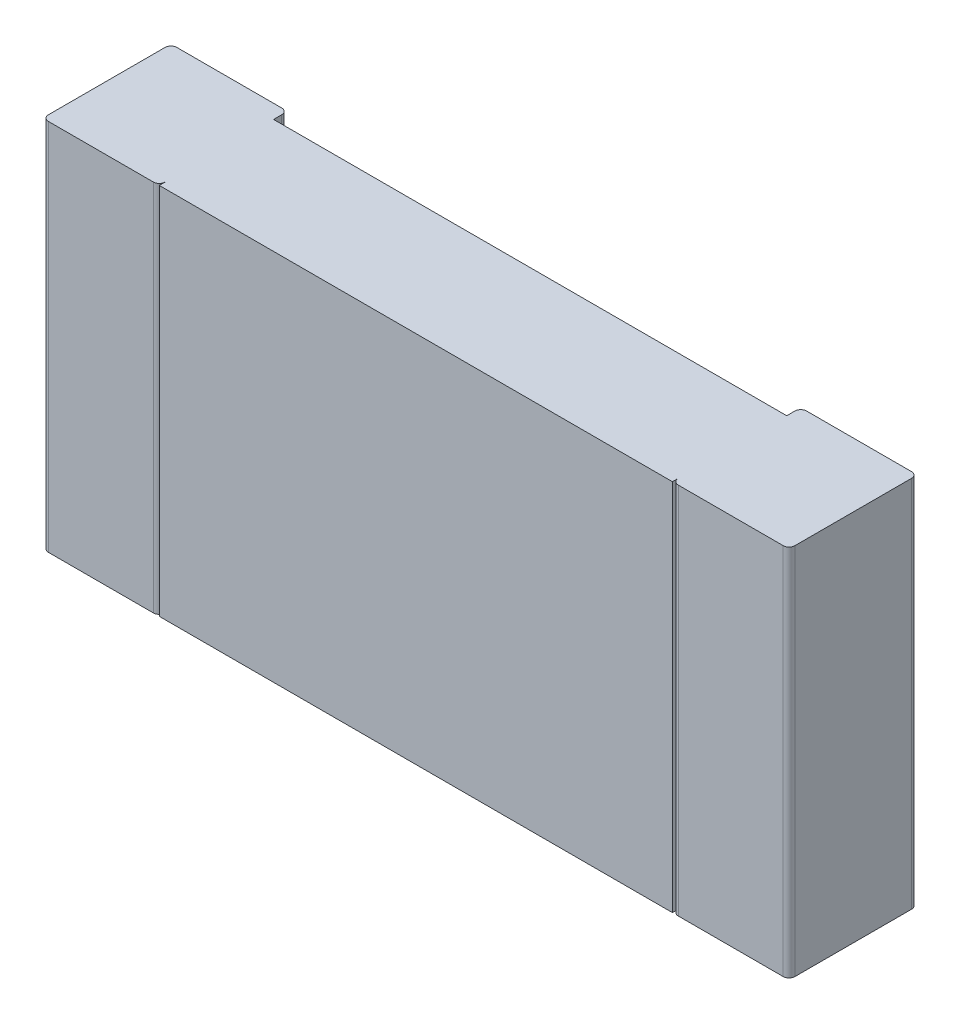
ISO-10303-21;
HEADER;
FILE_DESCRIPTION(('STEP AP214'),'2;1');
FILE_NAME('part.step','',(''),(''),'','','');
FILE_SCHEMA(('AUTOMOTIVE_DESIGN { 1 0 10303 214 1 1 1 1 }'));
ENDSEC;
DATA;
#1=APPLICATION_CONTEXT('core data for automotive mechanical design processes');
#2=APPLICATION_PROTOCOL_DEFINITION('international standard','automotive_design',2000,#1);
#3=PRODUCT_CONTEXT('',#1,'mechanical');
#4=PRODUCT('Part','Part','',(#3));
#5=PRODUCT_RELATED_PRODUCT_CATEGORY('part','',(#4));
#6=PRODUCT_DEFINITION_FORMATION('','',#4);
#7=PRODUCT_DEFINITION_CONTEXT('part definition',#1,'design');
#8=PRODUCT_DEFINITION('design','',#6,#7);
#9=PRODUCT_DEFINITION_SHAPE('','',#8);
#10=(LENGTH_UNIT() NAMED_UNIT(*) SI_UNIT(.MILLI.,.METRE.));
#11=(NAMED_UNIT(*) PLANE_ANGLE_UNIT() SI_UNIT($,.RADIAN.));
#12=(NAMED_UNIT(*) SI_UNIT($,.STERADIAN.) SOLID_ANGLE_UNIT());
#13=UNCERTAINTY_MEASURE_WITH_UNIT(LENGTH_MEASURE(1.E-05),#10,'distance_accuracy_value','');
#14=(GEOMETRIC_REPRESENTATION_CONTEXT(3) GLOBAL_UNCERTAINTY_ASSIGNED_CONTEXT((#13)) GLOBAL_UNIT_ASSIGNED_CONTEXT((#10,
#11,#12)) REPRESENTATION_CONTEXT('',''));
#15=CARTESIAN_POINT('',(0.,0.,0.));
#16=DIRECTION('',(0.,0.,1.));
#17=DIRECTION('',(1.,0.,0.));
#18=AXIS2_PLACEMENT_3D('',#15,#16,#17);
#19=CARTESIAN_POINT('',(-1.575,-0.8,0.025));
#20=DIRECTION('',(0.,1.,0.));
#21=DIRECTION('',(0.,0.,1.));
#22=AXIS2_PLACEMENT_3D('',#19,#20,#21);
#23=CYLINDRICAL_SURFACE('',#22,0.025);
#24=DIRECTION('',(0.,1.,0.));
#25=VECTOR('',#24,1.);
#26=CARTESIAN_POINT('',(-1.575,-0.8,0.));
#27=LINE('',#26,#25);
#28=CARTESIAN_POINT('',(-1.575,0.8,0.));
#29=VERTEX_POINT('',#28);
#30=CARTESIAN_POINT('',(-1.575,-0.8,0.));
#31=VERTEX_POINT('',#30);
#32=EDGE_CURVE('E199',#29,#31,#27,.F.);
#33=ORIENTED_EDGE('',*,*,#32,.T.);
#34=CARTESIAN_POINT('',(-1.575,-0.8,0.025));
#35=DIRECTION('',(0.,1.,0.));
#36=DIRECTION('',(0.,0.,1.));
#37=AXIS2_PLACEMENT_3D('',#34,#35,#36);
#38=CIRCLE('',#37,0.025);
#39=CARTESIAN_POINT('',(-1.6,-0.8,0.025));
#40=VERTEX_POINT('',#39);
#41=EDGE_CURVE('E161',#31,#40,#38,.T.);
#42=ORIENTED_EDGE('',*,*,#41,.T.);
#43=DIRECTION('',(0.,1.,0.));
#44=VECTOR('',#43,1.);
#45=CARTESIAN_POINT('',(-1.6,-0.8,0.025));
#46=LINE('',#45,#44);
#47=CARTESIAN_POINT('',(-1.6,0.8,0.025));
#48=VERTEX_POINT('',#47);
#49=EDGE_CURVE('E164',#40,#48,#46,.T.);
#50=ORIENTED_EDGE('',*,*,#49,.T.);
#51=CARTESIAN_POINT('',(-1.575,0.8,0.025));
#52=DIRECTION('',(0.,1.,0.));
#53=DIRECTION('',(0.,0.,1.));
#54=AXIS2_PLACEMENT_3D('',#51,#52,#53);
#55=CIRCLE('',#54,0.025);
#56=EDGE_CURVE('E20',#48,#29,#55,.F.);
#57=ORIENTED_EDGE('',*,*,#56,.T.);
#58=EDGE_LOOP('',(#33,#42,#50,#57));
#59=FACE_BOUND('',#58,.T.);
#60=ADVANCED_FACE('F17',(#59),#23,.T.);
#61=CARTESIAN_POINT('',(1.575,-0.8,0.025));
#62=DIRECTION('',(0.,1.,0.));
#63=DIRECTION('',(0.,0.,1.));
#64=AXIS2_PLACEMENT_3D('',#61,#62,#63);
#65=CYLINDRICAL_SURFACE('',#64,0.025);
#66=CARTESIAN_POINT('',(1.575,0.8,0.025));
#67=DIRECTION('',(0.,1.,0.));
#68=DIRECTION('',(0.,0.,1.));
#69=AXIS2_PLACEMENT_3D('',#66,#67,#68);
#70=CIRCLE('',#69,0.025);
#71=CARTESIAN_POINT('',(1.575,0.8,0.));
#72=VERTEX_POINT('',#71);
#73=CARTESIAN_POINT('',(1.6,0.8,0.025));
#74=VERTEX_POINT('',#73);
#75=EDGE_CURVE('E200',#72,#74,#70,.F.);
#76=ORIENTED_EDGE('',*,*,#75,.T.);
#77=DIRECTION('',(0.,1.,0.));
#78=VECTOR('',#77,1.);
#79=CARTESIAN_POINT('',(1.6,-0.8,0.025));
#80=LINE('',#79,#78);
#81=CARTESIAN_POINT('',(1.6,-0.8,0.025));
#82=VERTEX_POINT('',#81);
#83=EDGE_CURVE('E176',#82,#74,#80,.T.);
#84=ORIENTED_EDGE('',*,*,#83,.F.);
#85=CARTESIAN_POINT('',(1.575,-0.8,0.025));
#86=DIRECTION('',(0.,1.,0.));
#87=DIRECTION('',(0.,0.,1.));
#88=AXIS2_PLACEMENT_3D('',#85,#86,#87);
#89=CIRCLE('',#88,0.025);
#90=CARTESIAN_POINT('',(1.575,-0.8,0.));
#91=VERTEX_POINT('',#90);
#92=EDGE_CURVE('E244',#82,#91,#89,.T.);
#93=ORIENTED_EDGE('',*,*,#92,.T.);
#94=DIRECTION('',(0.,1.,0.));
#95=VECTOR('',#94,1.);
#96=CARTESIAN_POINT('',(1.575,-0.8,0.));
#97=LINE('',#96,#95);
#98=EDGE_CURVE('E182',#91,#72,#97,.T.);
#99=ORIENTED_EDGE('',*,*,#98,.T.);
#100=EDGE_LOOP('',(#76,#84,#93,#99));
#101=FACE_BOUND('',#100,.T.);
#102=ADVANCED_FACE('F249',(#101),#65,.T.);
#103=CARTESIAN_POINT('',(-1.6,-0.8,0.));
#104=DIRECTION('',(0.,0.,1.));
#105=DIRECTION('',(1.,0.,0.));
#106=AXIS2_PLACEMENT_3D('',#103,#104,#105);
#107=PLANE('',#106);
#108=DIRECTION('',(1.,0.,0.));
#109=VECTOR('',#108,1.);
#110=CARTESIAN_POINT('',(-1.6,-0.8,0.));
#111=LINE('',#110,#109);
#112=CARTESIAN_POINT('',(-1.125,-0.8,0.));
#113=VERTEX_POINT('',#112);
#114=EDGE_CURVE('E192',#31,#113,#111,.T.);
#115=ORIENTED_EDGE('',*,*,#114,.F.);
#116=ORIENTED_EDGE('',*,*,#32,.F.);
#117=DIRECTION('',(1.,0.,0.));
#118=VECTOR('',#117,1.);
#119=CARTESIAN_POINT('',(-1.6,0.8,0.));
#120=LINE('',#119,#118);
#121=CARTESIAN_POINT('',(-1.125,0.8,0.));
#122=VERTEX_POINT('',#121);
#123=EDGE_CURVE('E157',#122,#29,#120,.F.);
#124=ORIENTED_EDGE('',*,*,#123,.F.);
#125=DIRECTION('',(0.,1.,0.));
#126=VECTOR('',#125,1.);
#127=CARTESIAN_POINT('',(-1.125,-0.8,0.));
#128=LINE('',#127,#126);
#129=EDGE_CURVE('E193',#113,#122,#128,.T.);
#130=ORIENTED_EDGE('',*,*,#129,.F.);
#131=EDGE_LOOP('',(#115,#116,#124,#130));
#132=FACE_BOUND('',#131,.T.);
#133=ADVANCED_FACE('F543',(#132),#107,.F.);
#134=CARTESIAN_POINT('',(1.1,-0.8,0.));
#135=DIRECTION('',(0.,0.,1.));
#136=DIRECTION('',(1.,0.,0.));
#137=AXIS2_PLACEMENT_3D('',#134,#135,#136);
#138=PLANE('',#137);
#139=DIRECTION('',(1.,0.,0.));
#140=VECTOR('',#139,1.);
#141=CARTESIAN_POINT('',(1.1,-0.8,0.));
#142=LINE('',#141,#140);
#143=CARTESIAN_POINT('',(1.125,-0.8,0.));
#144=VERTEX_POINT('',#143);
#145=EDGE_CURVE('E188',#144,#91,#142,.T.);
#146=ORIENTED_EDGE('',*,*,#145,.F.);
#147=DIRECTION('',(0.,1.,0.));
#148=VECTOR('',#147,1.);
#149=CARTESIAN_POINT('',(1.125,-0.8,0.));
#150=LINE('',#149,#148);
#151=CARTESIAN_POINT('',(1.125,0.8,0.));
#152=VERTEX_POINT('',#151);
#153=EDGE_CURVE('E183',#152,#144,#150,.F.);
#154=ORIENTED_EDGE('',*,*,#153,.F.);
#155=DIRECTION('',(1.,0.,0.));
#156=VECTOR('',#155,1.);
#157=CARTESIAN_POINT('',(1.1,0.8,0.));
#158=LINE('',#157,#156);
#159=EDGE_CURVE('E190',#72,#152,#158,.F.);
#160=ORIENTED_EDGE('',*,*,#159,.F.);
#161=ORIENTED_EDGE('',*,*,#98,.F.);
#162=EDGE_LOOP('',(#146,#154,#160,#161));
#163=FACE_BOUND('',#162,.T.);
#164=ADVANCED_FACE('F253',(#163),#138,.F.);
#165=CARTESIAN_POINT('',(-1.6,-0.8,0.));
#166=DIRECTION('',(1.,0.,0.));
#167=DIRECTION('',(0.,0.,-1.));
#168=AXIS2_PLACEMENT_3D('',#165,#166,#167);
#169=PLANE('',#168);
#170=DIRECTION('',(0.,0.,-1.));
#171=VECTOR('',#170,1.);
#172=CARTESIAN_POINT('',(-1.6,0.8,0.));
#173=LINE('',#172,#171);
#174=CARTESIAN_POINT('',(-1.6,0.8,0.525));
#175=VERTEX_POINT('',#174);
#176=EDGE_CURVE('E154',#48,#175,#173,.F.);
#177=ORIENTED_EDGE('',*,*,#176,.F.);
#178=ORIENTED_EDGE('',*,*,#49,.F.);
#179=DIRECTION('',(0.,0.,-1.));
#180=VECTOR('',#179,1.);
#181=CARTESIAN_POINT('',(-1.6,-0.8,0.));
#182=LINE('',#181,#180);
#183=CARTESIAN_POINT('',(-1.6,-0.8,0.525));
#184=VERTEX_POINT('',#183);
#185=EDGE_CURVE('E167',#184,#40,#182,.T.);
#186=ORIENTED_EDGE('',*,*,#185,.F.);
#187=DIRECTION('',(0.,1.,0.));
#188=VECTOR('',#187,1.);
#189=CARTESIAN_POINT('',(-1.6,-0.8,0.525));
#190=LINE('',#189,#188);
#191=EDGE_CURVE('E171',#175,#184,#190,.F.);
#192=ORIENTED_EDGE('',*,*,#191,.F.);
#193=EDGE_LOOP('',(#177,#178,#186,#192));
#194=FACE_BOUND('',#193,.T.);
#195=ADVANCED_FACE('F169',(#194),#169,.F.);
#196=CARTESIAN_POINT('',(1.6,-0.8,0.));
#197=DIRECTION('',(1.,0.,0.));
#198=DIRECTION('',(0.,0.,-1.));
#199=AXIS2_PLACEMENT_3D('',#196,#197,#198);
#200=PLANE('',#199);
#201=DIRECTION('',(0.,0.,-1.));
#202=VECTOR('',#201,1.);
#203=CARTESIAN_POINT('',(1.6,0.8,0.));
#204=LINE('',#203,#202);
#205=CARTESIAN_POINT('',(1.6,0.8,0.525));
#206=VERTEX_POINT('',#205);
#207=EDGE_CURVE('E203',#74,#206,#204,.F.);
#208=ORIENTED_EDGE('',*,*,#207,.T.);
#209=DIRECTION('',(0.,1.,0.));
#210=VECTOR('',#209,1.);
#211=CARTESIAN_POINT('',(1.6,-0.8,0.525));
#212=LINE('',#211,#210);
#213=CARTESIAN_POINT('',(1.6,-0.8,0.525));
#214=VERTEX_POINT('',#213);
#215=EDGE_CURVE('E231',#214,#206,#212,.T.);
#216=ORIENTED_EDGE('',*,*,#215,.F.);
#217=DIRECTION('',(0.,0.,-1.));
#218=VECTOR('',#217,1.);
#219=CARTESIAN_POINT('',(1.6,-0.8,0.));
#220=LINE('',#219,#218);
#221=EDGE_CURVE('E173',#214,#82,#220,.T.);
#222=ORIENTED_EDGE('',*,*,#221,.T.);
#223=ORIENTED_EDGE('',*,*,#83,.T.);
#224=EDGE_LOOP('',(#208,#216,#222,#223));
#225=FACE_BOUND('',#224,.T.);
#226=ADVANCED_FACE('F262',(#225),#200,.T.);
#227=CARTESIAN_POINT('',(-1.125,-0.8,0.025));
#228=DIRECTION('',(0.,1.,0.));
#229=DIRECTION('',(0.,0.,1.));
#230=AXIS2_PLACEMENT_3D('',#227,#228,#229);
#231=CYLINDRICAL_SURFACE('',#230,0.025);
#232=CARTESIAN_POINT('',(-1.125,0.8,0.025));
#233=DIRECTION('',(0.,1.,0.));
#234=DIRECTION('',(0.,0.,1.));
#235=AXIS2_PLACEMENT_3D('',#232,#233,#234);
#236=CIRCLE('',#235,0.025);
#237=CARTESIAN_POINT('',(-1.1,0.8,0.025));
#238=VERTEX_POINT('',#237);
#239=EDGE_CURVE('E196',#122,#238,#236,.F.);
#240=ORIENTED_EDGE('',*,*,#239,.T.);
#241=DIRECTION('',(0.,1.,0.));
#242=VECTOR('',#241,1.);
#243=CARTESIAN_POINT('',(-1.1,-0.8,0.025));
#244=LINE('',#243,#242);
#245=CARTESIAN_POINT('',(-1.1,-0.8,0.025));
#246=VERTEX_POINT('',#245);
#247=EDGE_CURVE('E324',#246,#238,#244,.T.);
#248=ORIENTED_EDGE('',*,*,#247,.F.);
#249=CARTESIAN_POINT('',(-1.125,-0.8,0.025));
#250=DIRECTION('',(0.,1.,0.));
#251=DIRECTION('',(0.,0.,1.));
#252=AXIS2_PLACEMENT_3D('',#249,#250,#251);
#253=CIRCLE('',#252,0.025);
#254=EDGE_CURVE('E197',#246,#113,#253,.T.);
#255=ORIENTED_EDGE('',*,*,#254,.T.);
#256=ORIENTED_EDGE('',*,*,#129,.T.);
#257=EDGE_LOOP('',(#240,#248,#255,#256));
#258=FACE_BOUND('',#257,.T.);
#259=ADVANCED_FACE('F516',(#258),#231,.T.);
#260=CARTESIAN_POINT('',(1.125,-0.8,0.025));
#261=DIRECTION('',(0.,1.,0.));
#262=DIRECTION('',(0.,0.,1.));
#263=AXIS2_PLACEMENT_3D('',#260,#261,#262);
#264=CYLINDRICAL_SURFACE('',#263,0.025);
#265=ORIENTED_EDGE('',*,*,#153,.T.);
#266=CARTESIAN_POINT('',(1.125,-0.8,0.025));
#267=DIRECTION('',(0.,1.,0.));
#268=DIRECTION('',(0.,0.,1.));
#269=AXIS2_PLACEMENT_3D('',#266,#267,#268);
#270=CIRCLE('',#269,0.025);
#271=CARTESIAN_POINT('',(1.1,-0.8,0.025));
#272=VERTEX_POINT('',#271);
#273=EDGE_CURVE('E186',#144,#272,#270,.T.);
#274=ORIENTED_EDGE('',*,*,#273,.T.);
#275=DIRECTION('',(0.,1.,0.));
#276=VECTOR('',#275,1.);
#277=CARTESIAN_POINT('',(1.1,-0.8,0.025));
#278=LINE('',#277,#276);
#279=CARTESIAN_POINT('',(1.1,0.8,0.025));
#280=VERTEX_POINT('',#279);
#281=EDGE_CURVE('E316',#272,#280,#278,.T.);
#282=ORIENTED_EDGE('',*,*,#281,.T.);
#283=CARTESIAN_POINT('',(1.125,0.8,0.025));
#284=DIRECTION('',(0.,1.,0.));
#285=DIRECTION('',(0.,0.,1.));
#286=AXIS2_PLACEMENT_3D('',#283,#284,#285);
#287=CIRCLE('',#286,0.025);
#288=EDGE_CURVE('E187',#280,#152,#287,.F.);
#289=ORIENTED_EDGE('',*,*,#288,.T.);
#290=EDGE_LOOP('',(#265,#274,#282,#289));
#291=FACE_BOUND('',#290,.T.);
#292=ADVANCED_FACE('F509',(#291),#264,.T.);
#293=CARTESIAN_POINT('',(-1.575,-0.8,0.525));
#294=DIRECTION('',(0.,1.,0.));
#295=DIRECTION('',(0.,0.,1.));
#296=AXIS2_PLACEMENT_3D('',#293,#294,#295);
#297=CYLINDRICAL_SURFACE('',#296,0.025);
#298=CARTESIAN_POINT('',(-1.575,0.8,0.525));
#299=DIRECTION('',(0.,1.,0.));
#300=DIRECTION('',(0.,0.,1.));
#301=AXIS2_PLACEMENT_3D('',#298,#299,#300);
#302=CIRCLE('',#301,0.025);
#303=CARTESIAN_POINT('',(-1.575,0.8,0.55));
#304=VERTEX_POINT('',#303);
#305=EDGE_CURVE('E232',#304,#175,#302,.F.);
#306=ORIENTED_EDGE('',*,*,#305,.T.);
#307=ORIENTED_EDGE('',*,*,#191,.T.);
#308=CARTESIAN_POINT('',(-1.575,-0.8,0.525));
#309=DIRECTION('',(0.,1.,0.));
#310=DIRECTION('',(0.,0.,1.));
#311=AXIS2_PLACEMENT_3D('',#308,#309,#310);
#312=CIRCLE('',#311,0.025);
#313=CARTESIAN_POINT('',(-1.575,-0.8,0.55));
#314=VERTEX_POINT('',#313);
#315=EDGE_CURVE('E234',#184,#314,#312,.T.);
#316=ORIENTED_EDGE('',*,*,#315,.T.);
#317=DIRECTION('',(0.,1.,0.));
#318=VECTOR('',#317,1.);
#319=CARTESIAN_POINT('',(-1.575,-0.8,0.55));
#320=LINE('',#319,#318);
#321=EDGE_CURVE('E311',#304,#314,#320,.F.);
#322=ORIENTED_EDGE('',*,*,#321,.F.);
#323=EDGE_LOOP('',(#306,#307,#316,#322));
#324=FACE_BOUND('',#323,.T.);
#325=ADVANCED_FACE('F337',(#324),#297,.T.);
#326=CARTESIAN_POINT('',(1.575,-0.8,0.525));
#327=DIRECTION('',(0.,1.,0.));
#328=DIRECTION('',(0.,0.,1.));
#329=AXIS2_PLACEMENT_3D('',#326,#327,#328);
#330=CYLINDRICAL_SURFACE('',#329,0.025);
#331=DIRECTION('',(0.,1.,0.));
#332=VECTOR('',#331,1.);
#333=CARTESIAN_POINT('',(1.575,-0.8,0.55));
#334=LINE('',#333,#332);
#335=CARTESIAN_POINT('',(1.575,-0.8,0.55));
#336=VERTEX_POINT('',#335);
#337=CARTESIAN_POINT('',(1.575,0.8,0.55));
#338=VERTEX_POINT('',#337);
#339=EDGE_CURVE('E269',#336,#338,#334,.T.);
#340=ORIENTED_EDGE('',*,*,#339,.F.);
#341=CARTESIAN_POINT('',(1.575,-0.8,0.525));
#342=DIRECTION('',(0.,1.,0.));
#343=DIRECTION('',(0.,0.,1.));
#344=AXIS2_PLACEMENT_3D('',#341,#342,#343);
#345=CIRCLE('',#344,0.025);
#346=EDGE_CURVE('E224',#336,#214,#345,.T.);
#347=ORIENTED_EDGE('',*,*,#346,.T.);
#348=ORIENTED_EDGE('',*,*,#215,.T.);
#349=CARTESIAN_POINT('',(1.575,0.8,0.525));
#350=DIRECTION('',(0.,1.,0.));
#351=DIRECTION('',(0.,0.,1.));
#352=AXIS2_PLACEMENT_3D('',#349,#350,#351);
#353=CIRCLE('',#352,0.025);
#354=EDGE_CURVE('E228',#206,#338,#353,.F.);
#355=ORIENTED_EDGE('',*,*,#354,.T.);
#356=EDGE_LOOP('',(#340,#347,#348,#355));
#357=FACE_BOUND('',#356,.T.);
#358=ADVANCED_FACE('F270',(#357),#330,.T.);
#359=CARTESIAN_POINT('',(-1.1,-0.8,0.));
#360=DIRECTION('',(1.,0.,0.));
#361=DIRECTION('',(0.,0.,-1.));
#362=AXIS2_PLACEMENT_3D('',#359,#360,#361);
#363=PLANE('',#362);
#364=DIRECTION('',(0.,0.,-1.));
#365=VECTOR('',#364,1.);
#366=CARTESIAN_POINT('',(-1.1,0.8,0.));
#367=LINE('',#366,#365);
#368=CARTESIAN_POINT('',(-1.1,0.8,0.06));
#369=VERTEX_POINT('',#368);
#370=EDGE_CURVE('E317',#238,#369,#367,.F.);
#371=ORIENTED_EDGE('',*,*,#370,.T.);
#372=DIRECTION('',(0.,1.,0.));
#373=VECTOR('',#372,1.);
#374=CARTESIAN_POINT('',(-1.1,-0.8,0.06));
#375=LINE('',#374,#373);
#376=CARTESIAN_POINT('',(-1.1,-0.8,0.06));
#377=VERTEX_POINT('',#376);
#378=EDGE_CURVE('E272',#369,#377,#375,.F.);
#379=ORIENTED_EDGE('',*,*,#378,.T.);
#380=DIRECTION('',(0.,0.,-1.));
#381=VECTOR('',#380,1.);
#382=CARTESIAN_POINT('',(-1.1,-0.8,0.));
#383=LINE('',#382,#381);
#384=EDGE_CURVE('E227',#377,#246,#383,.T.);
#385=ORIENTED_EDGE('',*,*,#384,.T.);
#386=ORIENTED_EDGE('',*,*,#247,.T.);
#387=EDGE_LOOP('',(#371,#379,#385,#386));
#388=FACE_BOUND('',#387,.T.);
#389=ADVANCED_FACE('F488',(#388),#363,.T.);
#390=CARTESIAN_POINT('',(1.1,-0.8,0.));
#391=DIRECTION('',(1.,0.,0.));
#392=DIRECTION('',(0.,0.,-1.));
#393=AXIS2_PLACEMENT_3D('',#390,#391,#392);
#394=PLANE('',#393);
#395=DIRECTION('',(0.,0.,-1.));
#396=VECTOR('',#395,1.);
#397=CARTESIAN_POINT('',(1.1,0.8,0.));
#398=LINE('',#397,#396);
#399=CARTESIAN_POINT('',(1.1,0.8,0.06));
#400=VERTEX_POINT('',#399);
#401=EDGE_CURVE('E312',#280,#400,#398,.F.);
#402=ORIENTED_EDGE('',*,*,#401,.F.);
#403=ORIENTED_EDGE('',*,*,#281,.F.);
#404=DIRECTION('',(0.,0.,-1.));
#405=VECTOR('',#404,1.);
#406=CARTESIAN_POINT('',(1.1,-0.8,0.));
#407=LINE('',#406,#405);
#408=CARTESIAN_POINT('',(1.1,-0.8,0.06));
#409=VERTEX_POINT('',#408);
#410=EDGE_CURVE('E314',#409,#272,#407,.T.);
#411=ORIENTED_EDGE('',*,*,#410,.F.);
#412=DIRECTION('',(0.,1.,0.));
#413=VECTOR('',#412,1.);
#414=CARTESIAN_POINT('',(1.1,-0.8,0.06));
#415=LINE('',#414,#413);
#416=EDGE_CURVE('E293',#409,#400,#415,.T.);
#417=ORIENTED_EDGE('',*,*,#416,.T.);
#418=EDGE_LOOP('',(#402,#403,#411,#417));
#419=FACE_BOUND('',#418,.T.);
#420=ADVANCED_FACE('F481',(#419),#394,.F.);
#421=CARTESIAN_POINT('',(-1.6,-0.8,0.55));
#422=DIRECTION('',(0.,0.,1.));
#423=DIRECTION('',(1.,0.,0.));
#424=AXIS2_PLACEMENT_3D('',#421,#422,#423);
#425=PLANE('',#424);
#426=DIRECTION('',(1.,0.,0.));
#427=VECTOR('',#426,1.);
#428=CARTESIAN_POINT('',(-1.6,-0.8,0.55));
#429=LINE('',#428,#427);
#430=CARTESIAN_POINT('',(-1.125,-0.8,0.55));
#431=VERTEX_POINT('',#430);
#432=EDGE_CURVE('E302',#314,#431,#429,.T.);
#433=ORIENTED_EDGE('',*,*,#432,.T.);
#434=DIRECTION('',(0.,1.,0.));
#435=VECTOR('',#434,1.);
#436=CARTESIAN_POINT('',(-1.125,-0.8,0.55));
#437=LINE('',#436,#435);
#438=CARTESIAN_POINT('',(-1.125,0.8,0.55));
#439=VERTEX_POINT('',#438);
#440=EDGE_CURVE('E290',#439,#431,#437,.F.);
#441=ORIENTED_EDGE('',*,*,#440,.F.);
#442=DIRECTION('',(1.,0.,0.));
#443=VECTOR('',#442,1.);
#444=CARTESIAN_POINT('',(-1.6,0.8,0.55));
#445=LINE('',#444,#443);
#446=EDGE_CURVE('E308',#439,#304,#445,.F.);
#447=ORIENTED_EDGE('',*,*,#446,.T.);
#448=ORIENTED_EDGE('',*,*,#321,.T.);
#449=EDGE_LOOP('',(#433,#441,#447,#448));
#450=FACE_BOUND('',#449,.T.);
#451=ADVANCED_FACE('F345',(#450),#425,.T.);
#452=CARTESIAN_POINT('',(1.1,-0.8,0.55));
#453=DIRECTION('',(0.,0.,1.));
#454=DIRECTION('',(1.,0.,0.));
#455=AXIS2_PLACEMENT_3D('',#452,#453,#454);
#456=PLANE('',#455);
#457=DIRECTION('',(1.,0.,0.));
#458=VECTOR('',#457,1.);
#459=CARTESIAN_POINT('',(1.1,-0.8,0.55));
#460=LINE('',#459,#458);
#461=CARTESIAN_POINT('',(1.125,-0.8,0.55));
#462=VERTEX_POINT('',#461);
#463=EDGE_CURVE('E220',#462,#336,#460,.T.);
#464=ORIENTED_EDGE('',*,*,#463,.T.);
#465=ORIENTED_EDGE('',*,*,#339,.T.);
#466=DIRECTION('',(1.,0.,0.));
#467=VECTOR('',#466,1.);
#468=CARTESIAN_POINT('',(1.1,0.8,0.55));
#469=LINE('',#468,#467);
#470=CARTESIAN_POINT('',(1.125,0.8,0.55));
#471=VERTEX_POINT('',#470);
#472=EDGE_CURVE('E273',#338,#471,#469,.F.);
#473=ORIENTED_EDGE('',*,*,#472,.T.);
#474=DIRECTION('',(0.,1.,0.));
#475=VECTOR('',#474,1.);
#476=CARTESIAN_POINT('',(1.125,-0.8,0.55));
#477=LINE('',#476,#475);
#478=EDGE_CURVE('E219',#462,#471,#477,.T.);
#479=ORIENTED_EDGE('',*,*,#478,.F.);
#480=EDGE_LOOP('',(#464,#465,#473,#479));
#481=FACE_BOUND('',#480,.T.);
#482=ADVANCED_FACE('F275',(#481),#456,.T.);
#483=CARTESIAN_POINT('',(-1.54,-0.8,0.06));
#484=DIRECTION('',(0.,0.,1.));
#485=DIRECTION('',(1.,0.,0.));
#486=AXIS2_PLACEMENT_3D('',#483,#484,#485);
#487=PLANE('',#486);
#488=ORIENTED_EDGE('',*,*,#416,.F.);
#489=DIRECTION('',(1.,0.,0.));
#490=VECTOR('',#489,1.);
#491=CARTESIAN_POINT('',(-1.54,-0.8,0.06));
#492=LINE('',#491,#490);
#493=EDGE_CURVE('E223',#409,#377,#492,.F.);
#494=ORIENTED_EDGE('',*,*,#493,.T.);
#495=ORIENTED_EDGE('',*,*,#378,.F.);
#496=DIRECTION('',(1.,0.,0.));
#497=VECTOR('',#496,1.);
#498=CARTESIAN_POINT('',(-1.54,0.8,0.06));
#499=LINE('',#498,#497);
#500=EDGE_CURVE('E215',#400,#369,#499,.F.);
#501=ORIENTED_EDGE('',*,*,#500,.F.);
#502=EDGE_LOOP('',(#488,#494,#495,#501));
#503=FACE_BOUND('',#502,.T.);
#504=ADVANCED_FACE('F392',(#503),#487,.F.);
#505=CARTESIAN_POINT('',(-1.125,-0.8,0.525));
#506=DIRECTION('',(0.,1.,0.));
#507=DIRECTION('',(0.,0.,1.));
#508=AXIS2_PLACEMENT_3D('',#505,#506,#507);
#509=CYLINDRICAL_SURFACE('',#508,0.025);
#510=ORIENTED_EDGE('',*,*,#440,.T.);
#511=CARTESIAN_POINT('',(-1.125,-0.8,0.525));
#512=DIRECTION('',(0.,1.,0.));
#513=DIRECTION('',(0.,0.,1.));
#514=AXIS2_PLACEMENT_3D('',#511,#512,#513);
#515=CIRCLE('',#514,0.025);
#516=CARTESIAN_POINT('',(-1.1,-0.8,0.525));
#517=VERTEX_POINT('',#516);
#518=EDGE_CURVE('E221',#431,#517,#515,.T.);
#519=ORIENTED_EDGE('',*,*,#518,.T.);
#520=DIRECTION('',(0.,1.,0.));
#521=VECTOR('',#520,1.);
#522=CARTESIAN_POINT('',(-1.1,-0.8,0.525));
#523=LINE('',#522,#521);
#524=CARTESIAN_POINT('',(-1.1,0.8,0.525));
#525=VERTEX_POINT('',#524);
#526=EDGE_CURVE('E211',#517,#525,#523,.T.);
#527=ORIENTED_EDGE('',*,*,#526,.T.);
#528=CARTESIAN_POINT('',(-1.125,0.8,0.525));
#529=DIRECTION('',(0.,1.,0.));
#530=DIRECTION('',(0.,0.,1.));
#531=AXIS2_PLACEMENT_3D('',#528,#529,#530);
#532=CIRCLE('',#531,0.025);
#533=EDGE_CURVE('E212',#439,#525,#532,.T.);
#534=ORIENTED_EDGE('',*,*,#533,.F.);
#535=EDGE_LOOP('',(#510,#519,#527,#534));
#536=FACE_BOUND('',#535,.T.);
#537=ADVANCED_FACE('F348',(#536),#509,.T.);
#538=CARTESIAN_POINT('',(1.125,-0.8,0.525));
#539=DIRECTION('',(0.,1.,0.));
#540=DIRECTION('',(0.,0.,1.));
#541=AXIS2_PLACEMENT_3D('',#538,#539,#540);
#542=CYLINDRICAL_SURFACE('',#541,0.025);
#543=CARTESIAN_POINT('',(1.125,0.8,0.525));
#544=DIRECTION('',(0.,1.,0.));
#545=DIRECTION('',(0.,0.,1.));
#546=AXIS2_PLACEMENT_3D('',#543,#544,#545);
#547=CIRCLE('',#546,0.025);
#548=CARTESIAN_POINT('',(1.1,0.8,0.525));
#549=VERTEX_POINT('',#548);
#550=EDGE_CURVE('E208',#549,#471,#547,.T.);
#551=ORIENTED_EDGE('',*,*,#550,.F.);
#552=DIRECTION('',(0.,1.,0.));
#553=VECTOR('',#552,1.);
#554=CARTESIAN_POINT('',(1.1,-0.8,0.525));
#555=LINE('',#554,#553);
#556=CARTESIAN_POINT('',(1.1,-0.8,0.525));
#557=VERTEX_POINT('',#556);
#558=EDGE_CURVE('E359',#557,#549,#555,.T.);
#559=ORIENTED_EDGE('',*,*,#558,.F.);
#560=CARTESIAN_POINT('',(1.125,-0.8,0.525));
#561=DIRECTION('',(0.,1.,0.));
#562=DIRECTION('',(0.,0.,1.));
#563=AXIS2_PLACEMENT_3D('',#560,#561,#562);
#564=CIRCLE('',#563,0.025);
#565=EDGE_CURVE('E216',#557,#462,#564,.T.);
#566=ORIENTED_EDGE('',*,*,#565,.T.);
#567=ORIENTED_EDGE('',*,*,#478,.T.);
#568=EDGE_LOOP('',(#551,#559,#566,#567));
#569=FACE_BOUND('',#568,.T.);
#570=ADVANCED_FACE('F382',(#569),#542,.T.);
#571=CARTESIAN_POINT('',(-1.1,-0.8,0.49));
#572=DIRECTION('',(1.,0.,0.));
#573=DIRECTION('',(0.,0.,-1.));
#574=AXIS2_PLACEMENT_3D('',#571,#572,#573);
#575=PLANE('',#574);
#576=DIRECTION('',(0.,0.,1.));
#577=VECTOR('',#576,1.);
#578=CARTESIAN_POINT('',(-1.1,0.8,0.49));
#579=LINE('',#578,#577);
#580=CARTESIAN_POINT('',(-1.1,0.8,0.55));
#581=VERTEX_POINT('',#580);
#582=EDGE_CURVE('E355',#525,#581,#579,.T.);
#583=ORIENTED_EDGE('',*,*,#582,.F.);
#584=ORIENTED_EDGE('',*,*,#526,.F.);
#585=DIRECTION('',(0.,0.,1.));
#586=VECTOR('',#585,1.);
#587=CARTESIAN_POINT('',(-1.1,-0.8,0.49));
#588=LINE('',#587,#586);
#589=CARTESIAN_POINT('',(-1.1,-0.8,0.55));
#590=VERTEX_POINT('',#589);
#591=EDGE_CURVE('E282',#517,#590,#588,.T.);
#592=ORIENTED_EDGE('',*,*,#591,.T.);
#593=DIRECTION('',(0.,1.,0.));
#594=VECTOR('',#593,1.);
#595=CARTESIAN_POINT('',(-1.1,-0.8,0.55));
#596=LINE('',#595,#594);
#597=EDGE_CURVE('E363',#581,#590,#596,.F.);
#598=ORIENTED_EDGE('',*,*,#597,.F.);
#599=EDGE_LOOP('',(#583,#584,#592,#598));
#600=FACE_BOUND('',#599,.T.);
#601=ADVANCED_FACE('F384',(#600),#575,.F.);
#602=CARTESIAN_POINT('',(-1.1,-0.8,0.49));
#603=DIRECTION('',(0.,1.,0.));
#604=DIRECTION('',(0.,0.,1.));
#605=AXIS2_PLACEMENT_3D('',#602,#603,#604);
#606=PLANE('',#605);
#607=ORIENTED_EDGE('',*,*,#384,.F.);
#608=ORIENTED_EDGE('',*,*,#493,.F.);
#609=ORIENTED_EDGE('',*,*,#410,.T.);
#610=ORIENTED_EDGE('',*,*,#273,.F.);
#611=ORIENTED_EDGE('',*,*,#145,.T.);
#612=ORIENTED_EDGE('',*,*,#92,.F.);
#613=ORIENTED_EDGE('',*,*,#221,.F.);
#614=ORIENTED_EDGE('',*,*,#346,.F.);
#615=ORIENTED_EDGE('',*,*,#463,.F.);
#616=ORIENTED_EDGE('',*,*,#565,.F.);
#617=DIRECTION('',(0.,0.,-1.));
#618=VECTOR('',#617,1.);
#619=CARTESIAN_POINT('',(1.1,-0.8,0.49));
#620=LINE('',#619,#618);
#621=CARTESIAN_POINT('',(1.1,-0.8,0.55));
#622=VERTEX_POINT('',#621);
#623=EDGE_CURVE('E285',#622,#557,#620,.T.);
#624=ORIENTED_EDGE('',*,*,#623,.F.);
#625=DIRECTION('',(1.,0.,0.));
#626=VECTOR('',#625,1.);
#627=CARTESIAN_POINT('',(-1.1,-0.8,0.55));
#628=LINE('',#627,#626);
#629=EDGE_CURVE('E361',#590,#622,#628,.T.);
#630=ORIENTED_EDGE('',*,*,#629,.F.);
#631=ORIENTED_EDGE('',*,*,#591,.F.);
#632=ORIENTED_EDGE('',*,*,#518,.F.);
#633=ORIENTED_EDGE('',*,*,#432,.F.);
#634=ORIENTED_EDGE('',*,*,#315,.F.);
#635=ORIENTED_EDGE('',*,*,#185,.T.);
#636=ORIENTED_EDGE('',*,*,#41,.F.);
#637=ORIENTED_EDGE('',*,*,#114,.T.);
#638=ORIENTED_EDGE('',*,*,#254,.F.);
#639=EDGE_LOOP('',(#607,#608,#609,#610,#611,#612,#613,#614,#615,#616,#624,#630,#631,#632,#633,
#634,#635,#636,#637,#638));
#640=FACE_BOUND('',#639,.T.);
#641=ADVANCED_FACE('F263',(#640),#606,.F.);
#642=CARTESIAN_POINT('',(1.1,-0.8,0.49));
#643=DIRECTION('',(1.,0.,0.));
#644=DIRECTION('',(0.,0.,-1.));
#645=AXIS2_PLACEMENT_3D('',#642,#643,#644);
#646=PLANE('',#645);
#647=DIRECTION('',(0.,0.,1.));
#648=VECTOR('',#647,1.);
#649=CARTESIAN_POINT('',(1.1,0.8,0.49));
#650=LINE('',#649,#648);
#651=CARTESIAN_POINT('',(1.1,0.8,0.55));
#652=VERTEX_POINT('',#651);
#653=EDGE_CURVE('E35',#652,#549,#650,.F.);
#654=ORIENTED_EDGE('',*,*,#653,.F.);
#655=DIRECTION('',(0.,1.,0.));
#656=VECTOR('',#655,1.);
#657=CARTESIAN_POINT('',(1.1,-0.8,0.55));
#658=LINE('',#657,#656);
#659=EDGE_CURVE('E26',#622,#652,#658,.T.);
#660=ORIENTED_EDGE('',*,*,#659,.F.);
#661=ORIENTED_EDGE('',*,*,#623,.T.);
#662=ORIENTED_EDGE('',*,*,#558,.T.);
#663=EDGE_LOOP('',(#654,#660,#661,#662));
#664=FACE_BOUND('',#663,.T.);
#665=ADVANCED_FACE('F380',(#664),#646,.T.);
#666=CARTESIAN_POINT('',(-1.1,0.8,0.49));
#667=DIRECTION('',(0.,1.,0.));
#668=DIRECTION('',(0.,0.,1.));
#669=AXIS2_PLACEMENT_3D('',#666,#667,#668);
#670=PLANE('',#669);
#671=ORIENTED_EDGE('',*,*,#500,.T.);
#672=ORIENTED_EDGE('',*,*,#370,.F.);
#673=ORIENTED_EDGE('',*,*,#239,.F.);
#674=ORIENTED_EDGE('',*,*,#123,.T.);
#675=ORIENTED_EDGE('',*,*,#56,.F.);
#676=ORIENTED_EDGE('',*,*,#176,.T.);
#677=ORIENTED_EDGE('',*,*,#305,.F.);
#678=ORIENTED_EDGE('',*,*,#446,.F.);
#679=ORIENTED_EDGE('',*,*,#533,.T.);
#680=ORIENTED_EDGE('',*,*,#582,.T.);
#681=DIRECTION('',(1.,0.,0.));
#682=VECTOR('',#681,1.);
#683=CARTESIAN_POINT('',(-1.1,0.8,0.55));
#684=LINE('',#683,#682);
#685=EDGE_CURVE('E11',#652,#581,#684,.F.);
#686=ORIENTED_EDGE('',*,*,#685,.F.);
#687=ORIENTED_EDGE('',*,*,#653,.T.);
#688=ORIENTED_EDGE('',*,*,#550,.T.);
#689=ORIENTED_EDGE('',*,*,#472,.F.);
#690=ORIENTED_EDGE('',*,*,#354,.F.);
#691=ORIENTED_EDGE('',*,*,#207,.F.);
#692=ORIENTED_EDGE('',*,*,#75,.F.);
#693=ORIENTED_EDGE('',*,*,#159,.T.);
#694=ORIENTED_EDGE('',*,*,#288,.F.);
#695=ORIENTED_EDGE('',*,*,#401,.T.);
#696=EDGE_LOOP('',(#671,#672,#673,#674,#675,#676,#677,#678,#679,#680,#686,#687,#688,#689,#690,
#691,#692,#693,#694,#695));
#697=FACE_BOUND('',#696,.T.);
#698=ADVANCED_FACE('F152',(#697),#670,.T.);
#699=CARTESIAN_POINT('',(-1.1,-0.8,0.55));
#700=DIRECTION('',(0.,0.,1.));
#701=DIRECTION('',(1.,0.,0.));
#702=AXIS2_PLACEMENT_3D('',#699,#700,#701);
#703=PLANE('',#702);
#704=ORIENTED_EDGE('',*,*,#659,.T.);
#705=ORIENTED_EDGE('',*,*,#685,.T.);
#706=ORIENTED_EDGE('',*,*,#597,.T.);
#707=ORIENTED_EDGE('',*,*,#629,.T.);
#708=EDGE_LOOP('',(#704,#705,#706,#707));
#709=FACE_BOUND('',#708,.T.);
#710=ADVANCED_FACE('F379',(#709),#703,.T.);
#711=CLOSED_SHELL('',(#60,#102,#133,#164,#195,#226,#259,#292,#325,#358,#389,#420,#451,#482,#504,
#537,#570,#601,#641,#665,#698,#710));
#712=MANIFOLD_SOLID_BREP('B1',#711);
#713=ADVANCED_BREP_SHAPE_REPRESENTATION('',(#18,#712),#14);
#714=SHAPE_DEFINITION_REPRESENTATION(#9,#713);
ENDSEC;
END-ISO-10303-21;
